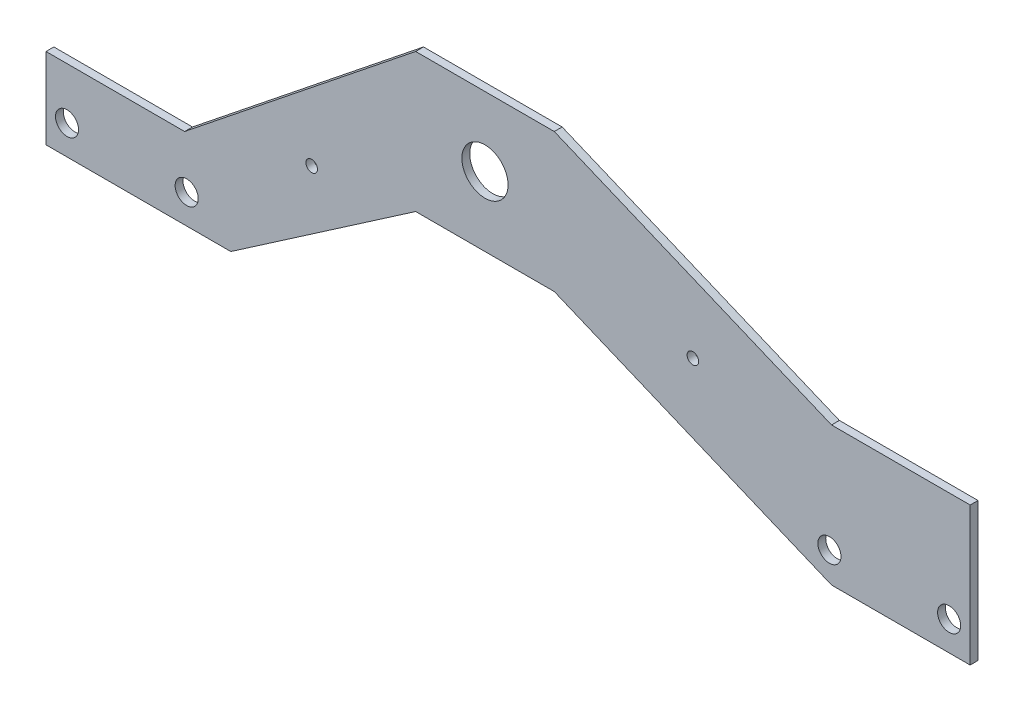
ISO-10303-21;
HEADER;
FILE_DESCRIPTION(('STEP AP214'),'2;1');
FILE_NAME('part.step','',(''),(''),'','','');
FILE_SCHEMA(('AUTOMOTIVE_DESIGN { 1 0 10303 214 1 1 1 1 }'));
ENDSEC;
DATA;
#1=APPLICATION_CONTEXT('core data for automotive mechanical design processes');
#2=APPLICATION_PROTOCOL_DEFINITION('international standard','automotive_design',2000,#1);
#3=PRODUCT_CONTEXT('',#1,'mechanical');
#4=PRODUCT('Part','Part','',(#3));
#5=PRODUCT_RELATED_PRODUCT_CATEGORY('part','',(#4));
#6=PRODUCT_DEFINITION_FORMATION('','',#4);
#7=PRODUCT_DEFINITION_CONTEXT('part definition',#1,'design');
#8=PRODUCT_DEFINITION('design','',#6,#7);
#9=PRODUCT_DEFINITION_SHAPE('','',#8);
#10=(LENGTH_UNIT() NAMED_UNIT(*) SI_UNIT(.MILLI.,.METRE.));
#11=(NAMED_UNIT(*) PLANE_ANGLE_UNIT() SI_UNIT($,.RADIAN.));
#12=(NAMED_UNIT(*) SI_UNIT($,.STERADIAN.) SOLID_ANGLE_UNIT());
#13=UNCERTAINTY_MEASURE_WITH_UNIT(LENGTH_MEASURE(1.E-05),#10,'distance_accuracy_value','');
#14=(GEOMETRIC_REPRESENTATION_CONTEXT(3) GLOBAL_UNCERTAINTY_ASSIGNED_CONTEXT((#13)) GLOBAL_UNIT_ASSIGNED_CONTEXT((#10,
#11,#12)) REPRESENTATION_CONTEXT('',''));
#15=CARTESIAN_POINT('',(0.,0.,0.));
#16=DIRECTION('',(0.,0.,1.));
#17=DIRECTION('',(1.,0.,0.));
#18=AXIS2_PLACEMENT_3D('',#15,#16,#17);
#19=CARTESIAN_POINT('',(215477.868987875,18112.8987341611,-1701.7));
#20=DIRECTION('',(0.,0.,1.));
#21=DIRECTION('',(1.,0.,0.));
#22=AXIS2_PLACEMENT_3D('',#19,#20,#21);
#23=PLANE('',#22);
#24=CARTESIAN_POINT('',(215538.768987875,18090.5987341611,-1701.7));
#25=DIRECTION('',(0.,0.,-1.));
#26=DIRECTION('',(-1.,0.,0.));
#27=AXIS2_PLACEMENT_3D('',#24,#25,#26);
#28=CIRCLE('',#27,5.00000000001207);
#29=CARTESIAN_POINT('',(215533.768987875,18090.5987341611,-1701.7));
#30=VERTEX_POINT('',#29);
#31=EDGE_CURVE('E277',#30,#30,#28,.T.);
#32=ORIENTED_EDGE('',*,*,#31,.F.);
#33=EDGE_LOOP('',(#32));
#34=FACE_BOUND('',#33,.T.);
#35=CARTESIAN_POINT('',(215868.768987875,18095.5987341611,-1701.7));
#36=DIRECTION('',(0.,0.,-1.));
#37=DIRECTION('',(-1.,0.,0.));
#38=AXIS2_PLACEMENT_3D('',#35,#36,#37);
#39=CIRCLE('',#38,5.00000000001207);
#40=CARTESIAN_POINT('',(215863.768987875,18095.5987341611,-1701.7));
#41=VERTEX_POINT('',#40);
#42=EDGE_CURVE('E291',#41,#41,#39,.T.);
#43=ORIENTED_EDGE('',*,*,#42,.F.);
#44=EDGE_LOOP('',(#43));
#45=FACE_BOUND('',#44,.T.);
#46=CARTESIAN_POINT('',(215592.868987875,18127.4687822065,-1701.7));
#47=DIRECTION('',(0.,0.,1.));
#48=DIRECTION('',(1.,0.,0.));
#49=AXIS2_PLACEMENT_3D('',#46,#47,#48);
#50=CIRCLE('',#49,2.50000000000001);
#51=CARTESIAN_POINT('',(215595.368987875,18127.4687822065,-1701.7));
#52=VERTEX_POINT('',#51);
#53=EDGE_CURVE('E294',#52,#52,#50,.T.);
#54=ORIENTED_EDGE('',*,*,#53,.T.);
#55=EDGE_LOOP('',(#54));
#56=FACE_BOUND('',#55,.T.);
#57=CARTESIAN_POINT('',(215757.868987875,18137.8987341611,-1701.7));
#58=DIRECTION('',(0.,0.,1.));
#59=DIRECTION('',(1.,0.,0.));
#60=AXIS2_PLACEMENT_3D('',#57,#58,#59);
#61=CIRCLE('',#60,2.50000000000001);
#62=CARTESIAN_POINT('',(215760.368987875,18137.8987341611,-1701.7));
#63=VERTEX_POINT('',#62);
#64=EDGE_CURVE('E300',#63,#63,#61,.T.);
#65=ORIENTED_EDGE('',*,*,#64,.T.);
#66=EDGE_LOOP('',(#65));
#67=FACE_BOUND('',#66,.T.);
#68=CARTESIAN_POINT('',(215667.868987875,18162.8987341611,-1701.7));
#69=DIRECTION('',(0.,0.,1.));
#70=DIRECTION('',(1.,0.,0.));
#71=AXIS2_PLACEMENT_3D('',#68,#69,#70);
#72=CIRCLE('',#71,9.99999999999999);
#73=CARTESIAN_POINT('',(215677.868987875,18162.8987341611,-1701.7));
#74=VERTEX_POINT('',#73);
#75=EDGE_CURVE('E166',#74,#74,#72,.T.);
#76=ORIENTED_EDGE('',*,*,#75,.T.);
#77=EDGE_LOOP('',(#76));
#78=FACE_BOUND('',#77,.T.);
#79=DIRECTION('',(-1.,0.,0.));
#80=VECTOR('',#79,1.);
#81=CARTESIAN_POINT('',(215477.868987875,18112.8987341611,-1701.7));
#82=LINE('',#81,#80);
#83=CARTESIAN_POINT('',(215537.868987875,18112.8987341611,-1701.7));
#84=VERTEX_POINT('',#83);
#85=CARTESIAN_POINT('',(215477.868987875,18112.8987341611,-1701.7));
#86=VERTEX_POINT('',#85);
#87=EDGE_CURVE('E195',#84,#86,#82,.T.);
#88=ORIENTED_EDGE('',*,*,#87,.F.);
#89=DIRECTION('',(-0.78086880944303,-0.624695047554424,0.));
#90=VECTOR('',#89,1.);
#91=CARTESIAN_POINT('',(215637.868987875,18192.8987341611,-1701.7));
#92=LINE('',#91,#90);
#93=CARTESIAN_POINT('',(215637.868987875,18192.8987341611,-1701.7));
#94=VERTEX_POINT('',#93);
#95=EDGE_CURVE('E152',#94,#84,#92,.T.);
#96=ORIENTED_EDGE('',*,*,#95,.F.);
#97=DIRECTION('',(-1.,0.,0.));
#98=VECTOR('',#97,1.);
#99=CARTESIAN_POINT('',(215697.868987875,18192.8987341611,-1701.7));
#100=LINE('',#99,#98);
#101=CARTESIAN_POINT('',(215697.868987875,18192.8987341611,-1701.7));
#102=VERTEX_POINT('',#101);
#103=EDGE_CURVE('E137',#102,#94,#100,.T.);
#104=ORIENTED_EDGE('',*,*,#103,.F.);
#105=DIRECTION('',(-0.923076923076923,0.384615384615384,0.));
#106=VECTOR('',#105,1.);
#107=CARTESIAN_POINT('',(215817.868987875,18142.8987341611,-1701.7));
#108=LINE('',#107,#106);
#109=CARTESIAN_POINT('',(215817.868987875,18142.8987341611,-1701.7));
#110=VERTEX_POINT('',#109);
#111=EDGE_CURVE('E150',#110,#102,#108,.T.);
#112=ORIENTED_EDGE('',*,*,#111,.F.);
#113=DIRECTION('',(-1.,0.,0.));
#114=VECTOR('',#113,1.);
#115=CARTESIAN_POINT('',(215877.868987875,18142.8987341611,-1701.7));
#116=LINE('',#115,#114);
#117=CARTESIAN_POINT('',(215877.868987875,18142.8987341611,-1701.7));
#118=VERTEX_POINT('',#117);
#119=EDGE_CURVE('E155',#118,#110,#116,.T.);
#120=ORIENTED_EDGE('',*,*,#119,.F.);
#121=DIRECTION('',(0.,1.,0.));
#122=VECTOR('',#121,1.);
#123=CARTESIAN_POINT('',(215877.868987875,18082.8987341611,-1701.7));
#124=LINE('',#123,#122);
#125=CARTESIAN_POINT('',(215877.868987875,18082.8987341611,-1701.7));
#126=VERTEX_POINT('',#125);
#127=EDGE_CURVE('E157',#126,#118,#124,.T.);
#128=ORIENTED_EDGE('',*,*,#127,.F.);
#129=DIRECTION('',(1.,0.,0.));
#130=VECTOR('',#129,1.);
#131=CARTESIAN_POINT('',(215817.868987875,18082.8987341611,-1701.7));
#132=LINE('',#131,#130);
#133=CARTESIAN_POINT('',(215817.868987875,18082.8987341611,-1701.7));
#134=VERTEX_POINT('',#133);
#135=EDGE_CURVE('E325',#134,#126,#132,.T.);
#136=ORIENTED_EDGE('',*,*,#135,.F.);
#137=DIRECTION('',(0.923076923076923,-0.384615384615384,0.));
#138=VECTOR('',#137,1.);
#139=CARTESIAN_POINT('',(215697.868987875,18132.8987341611,-1701.7));
#140=LINE('',#139,#138);
#141=CARTESIAN_POINT('',(215697.868987875,18132.8987341611,-1701.7));
#142=VERTEX_POINT('',#141);
#143=EDGE_CURVE('E322',#142,#134,#140,.T.);
#144=ORIENTED_EDGE('',*,*,#143,.F.);
#145=DIRECTION('',(1.,0.,0.));
#146=VECTOR('',#145,1.);
#147=CARTESIAN_POINT('',(215637.868987875,18132.8987341611,-1701.7));
#148=LINE('',#147,#146);
#149=CARTESIAN_POINT('',(215637.868987875,18132.8987341611,-1701.7));
#150=VERTEX_POINT('',#149);
#151=EDGE_CURVE('E319',#150,#142,#148,.T.);
#152=ORIENTED_EDGE('',*,*,#151,.F.);
#153=DIRECTION('',(0.824041924199368,0.566528822887065,0.));
#154=VECTOR('',#153,1.);
#155=CARTESIAN_POINT('',(215557.868987875,18077.8987341611,-1701.7));
#156=LINE('',#155,#154);
#157=CARTESIAN_POINT('',(215557.868987875,18077.8987341611,-1701.7));
#158=VERTEX_POINT('',#157);
#159=EDGE_CURVE('E316',#158,#150,#156,.T.);
#160=ORIENTED_EDGE('',*,*,#159,.F.);
#161=DIRECTION('',(1.,0.,0.));
#162=VECTOR('',#161,1.);
#163=CARTESIAN_POINT('',(215477.868987875,18077.8987341611,-1701.7));
#164=LINE('',#163,#162);
#165=CARTESIAN_POINT('',(215477.868987875,18077.8987341611,-1701.7));
#166=VERTEX_POINT('',#165);
#167=EDGE_CURVE('E313',#166,#158,#164,.T.);
#168=ORIENTED_EDGE('',*,*,#167,.F.);
#169=DIRECTION('',(0.,-1.,0.));
#170=VECTOR('',#169,1.);
#171=CARTESIAN_POINT('',(215477.868987875,18112.8987341611,-1701.7));
#172=LINE('',#171,#170);
#173=EDGE_CURVE('E311',#86,#166,#172,.T.);
#174=ORIENTED_EDGE('',*,*,#173,.F.);
#175=EDGE_LOOP('',(#88,#96,#104,#112,#120,#128,#136,#144,#152,#160,#168,#174));
#176=FACE_BOUND('',#175,.T.);
#177=CARTESIAN_POINT('',(215816.968987875,18095.5987341611,-1701.7));
#178=DIRECTION('',(0.,0.,-1.));
#179=DIRECTION('',(-1.,0.,0.));
#180=AXIS2_PLACEMENT_3D('',#177,#178,#179);
#181=CIRCLE('',#180,4.99999999998281);
#182=CARTESIAN_POINT('',(215811.968987875,18095.5987341611,-1701.7));
#183=VERTEX_POINT('',#182);
#184=EDGE_CURVE('E285',#183,#183,#181,.F.);
#185=ORIENTED_EDGE('',*,*,#184,.T.);
#186=EDGE_LOOP('',(#185));
#187=FACE_BOUND('',#186,.T.);
#188=CARTESIAN_POINT('',(215486.968987875,18090.5987341611,-1701.7));
#189=DIRECTION('',(0.,0.,-1.));
#190=DIRECTION('',(-1.,0.,0.));
#191=AXIS2_PLACEMENT_3D('',#188,#189,#190);
#192=CIRCLE('',#191,4.99999999998281);
#193=CARTESIAN_POINT('',(215481.968987875,18090.5987341611,-1701.7));
#194=VERTEX_POINT('',#193);
#195=EDGE_CURVE('E270',#194,#194,#192,.F.);
#196=ORIENTED_EDGE('',*,*,#195,.T.);
#197=EDGE_LOOP('',(#196));
#198=FACE_BOUND('',#197,.T.);
#199=ADVANCED_FACE('F40',(#34,#45,#56,#67,#78,#176,#187,#198),#23,.F.);
#200=CARTESIAN_POINT('',(215477.868987875,18112.8987341611,-1698.3));
#201=DIRECTION('',(0.,0.,1.));
#202=DIRECTION('',(1.,0.,0.));
#203=AXIS2_PLACEMENT_3D('',#200,#201,#202);
#204=PLANE('',#203);
#205=CARTESIAN_POINT('',(215816.968987875,18095.5987341611,-1698.3));
#206=DIRECTION('',(0.,0.,-1.));
#207=DIRECTION('',(-1.,0.,0.));
#208=AXIS2_PLACEMENT_3D('',#205,#206,#207);
#209=CIRCLE('',#208,4.99999999998281);
#210=CARTESIAN_POINT('',(215811.968987875,18095.5987341611,-1698.3));
#211=VERTEX_POINT('',#210);
#212=EDGE_CURVE('E282',#211,#211,#209,.F.);
#213=ORIENTED_EDGE('',*,*,#212,.F.);
#214=EDGE_LOOP('',(#213));
#215=FACE_BOUND('',#214,.T.);
#216=CARTESIAN_POINT('',(215868.768987875,18095.5987341611,-1698.3));
#217=DIRECTION('',(0.,0.,-1.));
#218=DIRECTION('',(-1.,0.,0.));
#219=AXIS2_PLACEMENT_3D('',#216,#217,#218);
#220=CIRCLE('',#219,5.00000000001207);
#221=CARTESIAN_POINT('',(215863.768987875,18095.5987341611,-1698.3));
#222=VERTEX_POINT('',#221);
#223=EDGE_CURVE('E288',#222,#222,#220,.T.);
#224=ORIENTED_EDGE('',*,*,#223,.T.);
#225=EDGE_LOOP('',(#224));
#226=FACE_BOUND('',#225,.T.);
#227=CARTESIAN_POINT('',(215592.868987875,18127.4687822065,-1698.3));
#228=DIRECTION('',(0.,0.,1.));
#229=DIRECTION('',(1.,0.,0.));
#230=AXIS2_PLACEMENT_3D('',#227,#228,#229);
#231=CIRCLE('',#230,2.50000000000001);
#232=CARTESIAN_POINT('',(215595.368987875,18127.4687822065,-1698.3));
#233=VERTEX_POINT('',#232);
#234=EDGE_CURVE('E274',#233,#233,#231,.T.);
#235=ORIENTED_EDGE('',*,*,#234,.F.);
#236=EDGE_LOOP('',(#235));
#237=FACE_BOUND('',#236,.T.);
#238=CARTESIAN_POINT('',(215757.868987875,18137.8987341611,-1698.3));
#239=DIRECTION('',(0.,0.,1.));
#240=DIRECTION('',(1.,0.,0.));
#241=AXIS2_PLACEMENT_3D('',#238,#239,#240);
#242=CIRCLE('',#241,2.50000000000001);
#243=CARTESIAN_POINT('',(215760.368987875,18137.8987341611,-1698.3));
#244=VERTEX_POINT('',#243);
#245=EDGE_CURVE('E297',#244,#244,#242,.T.);
#246=ORIENTED_EDGE('',*,*,#245,.F.);
#247=EDGE_LOOP('',(#246));
#248=FACE_BOUND('',#247,.T.);
#249=CARTESIAN_POINT('',(215667.868987875,18162.8987341611,-1698.3));
#250=DIRECTION('',(0.,0.,1.));
#251=DIRECTION('',(1.,0.,0.));
#252=AXIS2_PLACEMENT_3D('',#249,#250,#251);
#253=CIRCLE('',#252,9.99999999999999);
#254=CARTESIAN_POINT('',(215677.868987875,18162.8987341611,-1698.3));
#255=VERTEX_POINT('',#254);
#256=EDGE_CURVE('E303',#255,#255,#253,.T.);
#257=ORIENTED_EDGE('',*,*,#256,.F.);
#258=EDGE_LOOP('',(#257));
#259=FACE_BOUND('',#258,.T.);
#260=DIRECTION('',(-1.,0.,0.));
#261=VECTOR('',#260,1.);
#262=CARTESIAN_POINT('',(215477.868987875,18112.8987341611,-1698.3));
#263=LINE('',#262,#261);
#264=CARTESIAN_POINT('',(215537.868987875,18112.8987341611,-1698.3));
#265=VERTEX_POINT('',#264);
#266=CARTESIAN_POINT('',(215477.868987875,18112.8987341611,-1698.3));
#267=VERTEX_POINT('',#266);
#268=EDGE_CURVE('E162',#265,#267,#263,.T.);
#269=ORIENTED_EDGE('',*,*,#268,.T.);
#270=DIRECTION('',(0.,-1.,0.));
#271=VECTOR('',#270,1.);
#272=CARTESIAN_POINT('',(215477.868987875,18112.8987341611,-1698.3));
#273=LINE('',#272,#271);
#274=CARTESIAN_POINT('',(215477.868987875,18077.8987341611,-1698.3));
#275=VERTEX_POINT('',#274);
#276=EDGE_CURVE('E165',#267,#275,#273,.T.);
#277=ORIENTED_EDGE('',*,*,#276,.T.);
#278=DIRECTION('',(1.,0.,0.));
#279=VECTOR('',#278,1.);
#280=CARTESIAN_POINT('',(215477.868987875,18077.8987341611,-1698.3));
#281=LINE('',#280,#279);
#282=CARTESIAN_POINT('',(215557.868987875,18077.8987341611,-1698.3));
#283=VERTEX_POINT('',#282);
#284=EDGE_CURVE('E169',#275,#283,#281,.T.);
#285=ORIENTED_EDGE('',*,*,#284,.T.);
#286=DIRECTION('',(0.824041924199368,0.566528822887065,0.));
#287=VECTOR('',#286,1.);
#288=CARTESIAN_POINT('',(215557.868987875,18077.8987341611,-1698.3));
#289=LINE('',#288,#287);
#290=CARTESIAN_POINT('',(215637.868987875,18132.8987341611,-1698.3));
#291=VERTEX_POINT('',#290);
#292=EDGE_CURVE('E172',#283,#291,#289,.T.);
#293=ORIENTED_EDGE('',*,*,#292,.T.);
#294=DIRECTION('',(1.,0.,0.));
#295=VECTOR('',#294,1.);
#296=CARTESIAN_POINT('',(215637.868987875,18132.8987341611,-1698.3));
#297=LINE('',#296,#295);
#298=CARTESIAN_POINT('',(215697.868987875,18132.8987341611,-1698.3));
#299=VERTEX_POINT('',#298);
#300=EDGE_CURVE('E175',#291,#299,#297,.T.);
#301=ORIENTED_EDGE('',*,*,#300,.T.);
#302=DIRECTION('',(0.923076923076923,-0.384615384615384,0.));
#303=VECTOR('',#302,1.);
#304=CARTESIAN_POINT('',(215697.868987875,18132.8987341611,-1698.3));
#305=LINE('',#304,#303);
#306=CARTESIAN_POINT('',(215817.868987875,18082.8987341611,-1698.3));
#307=VERTEX_POINT('',#306);
#308=EDGE_CURVE('E178',#299,#307,#305,.T.);
#309=ORIENTED_EDGE('',*,*,#308,.T.);
#310=DIRECTION('',(1.,0.,0.));
#311=VECTOR('',#310,1.);
#312=CARTESIAN_POINT('',(215817.868987875,18082.8987341611,-1698.3));
#313=LINE('',#312,#311);
#314=CARTESIAN_POINT('',(215877.868987875,18082.8987341611,-1698.3));
#315=VERTEX_POINT('',#314);
#316=EDGE_CURVE('E181',#307,#315,#313,.T.);
#317=ORIENTED_EDGE('',*,*,#316,.T.);
#318=DIRECTION('',(0.,1.,0.));
#319=VECTOR('',#318,1.);
#320=CARTESIAN_POINT('',(215877.868987875,18082.8987341611,-1698.3));
#321=LINE('',#320,#319);
#322=CARTESIAN_POINT('',(215877.868987875,18142.8987341611,-1698.3));
#323=VERTEX_POINT('',#322);
#324=EDGE_CURVE('E184',#315,#323,#321,.T.);
#325=ORIENTED_EDGE('',*,*,#324,.T.);
#326=DIRECTION('',(-1.,0.,0.));
#327=VECTOR('',#326,1.);
#328=CARTESIAN_POINT('',(215877.868987875,18142.8987341611,-1698.3));
#329=LINE('',#328,#327);
#330=CARTESIAN_POINT('',(215817.868987875,18142.8987341611,-1698.3));
#331=VERTEX_POINT('',#330);
#332=EDGE_CURVE('E187',#323,#331,#329,.T.);
#333=ORIENTED_EDGE('',*,*,#332,.T.);
#334=DIRECTION('',(-0.923076923076923,0.384615384615384,0.));
#335=VECTOR('',#334,1.);
#336=CARTESIAN_POINT('',(215817.868987875,18142.8987341611,-1698.3));
#337=LINE('',#336,#335);
#338=CARTESIAN_POINT('',(215697.868987875,18192.8987341611,-1698.3));
#339=VERTEX_POINT('',#338);
#340=EDGE_CURVE('E190',#331,#339,#337,.T.);
#341=ORIENTED_EDGE('',*,*,#340,.T.);
#342=DIRECTION('',(-1.,0.,0.));
#343=VECTOR('',#342,1.);
#344=CARTESIAN_POINT('',(215697.868987875,18192.8987341611,-1698.3));
#345=LINE('',#344,#343);
#346=CARTESIAN_POINT('',(215637.868987875,18192.8987341611,-1698.3));
#347=VERTEX_POINT('',#346);
#348=EDGE_CURVE('E139',#339,#347,#345,.T.);
#349=ORIENTED_EDGE('',*,*,#348,.T.);
#350=DIRECTION('',(-0.78086880944303,-0.624695047554424,0.));
#351=VECTOR('',#350,1.);
#352=CARTESIAN_POINT('',(215637.868987875,18192.8987341611,-1698.3));
#353=LINE('',#352,#351);
#354=EDGE_CURVE('E193',#347,#265,#353,.T.);
#355=ORIENTED_EDGE('',*,*,#354,.T.);
#356=EDGE_LOOP('',(#269,#277,#285,#293,#301,#309,#317,#325,#333,#341,#349,#355));
#357=FACE_BOUND('',#356,.T.);
#358=CARTESIAN_POINT('',(215538.768987875,18090.5987341611,-1698.3));
#359=DIRECTION('',(0.,0.,-1.));
#360=DIRECTION('',(-1.,0.,0.));
#361=AXIS2_PLACEMENT_3D('',#358,#359,#360);
#362=CIRCLE('',#361,5.00000000001207);
#363=CARTESIAN_POINT('',(215533.768987875,18090.5987341611,-1698.3));
#364=VERTEX_POINT('',#363);
#365=EDGE_CURVE('E272',#364,#364,#362,.T.);
#366=ORIENTED_EDGE('',*,*,#365,.T.);
#367=EDGE_LOOP('',(#366));
#368=FACE_BOUND('',#367,.T.);
#369=CARTESIAN_POINT('',(215486.968987875,18090.5987341611,-1698.3));
#370=DIRECTION('',(0.,0.,-1.));
#371=DIRECTION('',(-1.,0.,0.));
#372=AXIS2_PLACEMENT_3D('',#369,#370,#371);
#373=CIRCLE('',#372,4.99999999998281);
#374=CARTESIAN_POINT('',(215481.968987875,18090.5987341611,-1698.3));
#375=VERTEX_POINT('',#374);
#376=EDGE_CURVE('E267',#375,#375,#373,.F.);
#377=ORIENTED_EDGE('',*,*,#376,.F.);
#378=EDGE_LOOP('',(#377));
#379=FACE_BOUND('',#378,.T.);
#380=ADVANCED_FACE('F214',(#215,#226,#237,#248,#259,#357,#368,#379),#204,.T.);
#381=CARTESIAN_POINT('',(215477.868987875,18112.8987341611,-1701.7));
#382=DIRECTION('',(0.,1.,0.));
#383=DIRECTION('',(0.,0.,1.));
#384=AXIS2_PLACEMENT_3D('',#381,#382,#383);
#385=PLANE('',#384);
#386=ORIENTED_EDGE('',*,*,#268,.F.);
#387=DIRECTION('',(0.,0.,1.));
#388=VECTOR('',#387,1.);
#389=CARTESIAN_POINT('',(215537.868987875,18112.8987341611,-1701.7));
#390=LINE('',#389,#388);
#391=EDGE_CURVE('E11',#84,#265,#390,.T.);
#392=ORIENTED_EDGE('',*,*,#391,.F.);
#393=ORIENTED_EDGE('',*,*,#87,.T.);
#394=DIRECTION('',(0.,0.,1.));
#395=VECTOR('',#394,1.);
#396=CARTESIAN_POINT('',(215477.868987875,18112.8987341611,-1701.7));
#397=LINE('',#396,#395);
#398=EDGE_CURVE('E44',#86,#267,#397,.T.);
#399=ORIENTED_EDGE('',*,*,#398,.T.);
#400=EDGE_LOOP('',(#386,#392,#393,#399));
#401=FACE_BOUND('',#400,.T.);
#402=ADVANCED_FACE('F42',(#401),#385,.T.);
#403=CARTESIAN_POINT('',(215637.868987875,18192.8987341611,-1701.7));
#404=DIRECTION('',(-0.624695047554424,0.78086880944303,0.));
#405=DIRECTION('',(-0.78086880944303,-0.624695047554424,0.));
#406=AXIS2_PLACEMENT_3D('',#403,#404,#405);
#407=PLANE('',#406);
#408=ORIENTED_EDGE('',*,*,#354,.F.);
#409=DIRECTION('',(0.,0.,1.));
#410=VECTOR('',#409,1.);
#411=CARTESIAN_POINT('',(215637.868987875,18192.8987341611,-1701.7));
#412=LINE('',#411,#410);
#413=EDGE_CURVE('E50',#94,#347,#412,.T.);
#414=ORIENTED_EDGE('',*,*,#413,.F.);
#415=ORIENTED_EDGE('',*,*,#95,.T.);
#416=ORIENTED_EDGE('',*,*,#391,.T.);
#417=EDGE_LOOP('',(#408,#414,#415,#416));
#418=FACE_BOUND('',#417,.T.);
#419=ADVANCED_FACE('F216',(#418),#407,.T.);
#420=CARTESIAN_POINT('',(215697.868987875,18192.8987341611,-1701.7));
#421=DIRECTION('',(0.,1.,0.));
#422=DIRECTION('',(0.,0.,1.));
#423=AXIS2_PLACEMENT_3D('',#420,#421,#422);
#424=PLANE('',#423);
#425=ORIENTED_EDGE('',*,*,#348,.F.);
#426=DIRECTION('',(0.,0.,1.));
#427=VECTOR('',#426,1.);
#428=CARTESIAN_POINT('',(215697.868987875,18192.8987341611,-1701.7));
#429=LINE('',#428,#427);
#430=EDGE_CURVE('E134',#102,#339,#429,.T.);
#431=ORIENTED_EDGE('',*,*,#430,.F.);
#432=ORIENTED_EDGE('',*,*,#103,.T.);
#433=ORIENTED_EDGE('',*,*,#413,.T.);
#434=EDGE_LOOP('',(#425,#431,#432,#433));
#435=FACE_BOUND('',#434,.T.);
#436=ADVANCED_FACE('F136',(#435),#424,.T.);
#437=CARTESIAN_POINT('',(215817.868987875,18142.8987341611,-1701.7));
#438=DIRECTION('',(0.384615384615384,0.923076923076923,0.));
#439=DIRECTION('',(-0.923076923076924,0.384615384615384,0.));
#440=AXIS2_PLACEMENT_3D('',#437,#438,#439);
#441=PLANE('',#440);
#442=ORIENTED_EDGE('',*,*,#340,.F.);
#443=DIRECTION('',(0.,0.,1.));
#444=VECTOR('',#443,1.);
#445=CARTESIAN_POINT('',(215817.868987875,18142.8987341611,-1701.7));
#446=LINE('',#445,#444);
#447=EDGE_CURVE('E144',#110,#331,#446,.T.);
#448=ORIENTED_EDGE('',*,*,#447,.F.);
#449=ORIENTED_EDGE('',*,*,#111,.T.);
#450=ORIENTED_EDGE('',*,*,#430,.T.);
#451=EDGE_LOOP('',(#442,#448,#449,#450));
#452=FACE_BOUND('',#451,.T.);
#453=ADVANCED_FACE('F154',(#452),#441,.T.);
#454=CARTESIAN_POINT('',(215877.868987875,18142.8987341611,-1701.7));
#455=DIRECTION('',(0.,1.,0.));
#456=DIRECTION('',(0.,0.,1.));
#457=AXIS2_PLACEMENT_3D('',#454,#455,#456);
#458=PLANE('',#457);
#459=ORIENTED_EDGE('',*,*,#332,.F.);
#460=DIRECTION('',(0.,0.,1.));
#461=VECTOR('',#460,1.);
#462=CARTESIAN_POINT('',(215877.868987875,18142.8987341611,-1701.7));
#463=LINE('',#462,#461);
#464=EDGE_CURVE('E199',#118,#323,#463,.T.);
#465=ORIENTED_EDGE('',*,*,#464,.F.);
#466=ORIENTED_EDGE('',*,*,#119,.T.);
#467=ORIENTED_EDGE('',*,*,#447,.T.);
#468=EDGE_LOOP('',(#459,#465,#466,#467));
#469=FACE_BOUND('',#468,.T.);
#470=ADVANCED_FACE('F353',(#469),#458,.T.);
#471=CARTESIAN_POINT('',(215877.868987875,18082.8987341611,-1701.7));
#472=DIRECTION('',(1.,0.,0.));
#473=DIRECTION('',(0.,0.,-1.));
#474=AXIS2_PLACEMENT_3D('',#471,#472,#473);
#475=PLANE('',#474);
#476=ORIENTED_EDGE('',*,*,#324,.F.);
#477=DIRECTION('',(0.,0.,1.));
#478=VECTOR('',#477,1.);
#479=CARTESIAN_POINT('',(215877.868987875,18082.8987341611,-1701.7));
#480=LINE('',#479,#478);
#481=EDGE_CURVE('E201',#126,#315,#480,.T.);
#482=ORIENTED_EDGE('',*,*,#481,.F.);
#483=ORIENTED_EDGE('',*,*,#127,.T.);
#484=ORIENTED_EDGE('',*,*,#464,.T.);
#485=EDGE_LOOP('',(#476,#482,#483,#484));
#486=FACE_BOUND('',#485,.T.);
#487=ADVANCED_FACE('F331',(#486),#475,.T.);
#488=CARTESIAN_POINT('',(215817.868987875,18082.8987341611,-1701.7));
#489=DIRECTION('',(0.,-1.,0.));
#490=DIRECTION('',(0.,0.,-1.));
#491=AXIS2_PLACEMENT_3D('',#488,#489,#490);
#492=PLANE('',#491);
#493=ORIENTED_EDGE('',*,*,#316,.F.);
#494=DIRECTION('',(0.,0.,1.));
#495=VECTOR('',#494,1.);
#496=CARTESIAN_POINT('',(215817.868987875,18082.8987341611,-1701.7));
#497=LINE('',#496,#495);
#498=EDGE_CURVE('E203',#134,#307,#497,.T.);
#499=ORIENTED_EDGE('',*,*,#498,.F.);
#500=ORIENTED_EDGE('',*,*,#135,.T.);
#501=ORIENTED_EDGE('',*,*,#481,.T.);
#502=EDGE_LOOP('',(#493,#499,#500,#501));
#503=FACE_BOUND('',#502,.T.);
#504=ADVANCED_FACE('F337',(#503),#492,.T.);
#505=CARTESIAN_POINT('',(215697.868987875,18132.8987341611,-1701.7));
#506=DIRECTION('',(-0.384615384615384,-0.923076923076923,0.));
#507=DIRECTION('',(0.923076923076923,-0.384615384615384,0.));
#508=AXIS2_PLACEMENT_3D('',#505,#506,#507);
#509=PLANE('',#508);
#510=ORIENTED_EDGE('',*,*,#308,.F.);
#511=DIRECTION('',(0.,0.,1.));
#512=VECTOR('',#511,1.);
#513=CARTESIAN_POINT('',(215697.868987875,18132.8987341611,-1701.7));
#514=LINE('',#513,#512);
#515=EDGE_CURVE('E205',#142,#299,#514,.T.);
#516=ORIENTED_EDGE('',*,*,#515,.F.);
#517=ORIENTED_EDGE('',*,*,#143,.T.);
#518=ORIENTED_EDGE('',*,*,#498,.T.);
#519=EDGE_LOOP('',(#510,#516,#517,#518));
#520=FACE_BOUND('',#519,.T.);
#521=ADVANCED_FACE('F340',(#520),#509,.T.);
#522=CARTESIAN_POINT('',(215637.868987875,18132.8987341611,-1701.7));
#523=DIRECTION('',(0.,-1.,0.));
#524=DIRECTION('',(0.,0.,-1.));
#525=AXIS2_PLACEMENT_3D('',#522,#523,#524);
#526=PLANE('',#525);
#527=ORIENTED_EDGE('',*,*,#300,.F.);
#528=DIRECTION('',(0.,0.,1.));
#529=VECTOR('',#528,1.);
#530=CARTESIAN_POINT('',(215637.868987875,18132.8987341611,-1701.7));
#531=LINE('',#530,#529);
#532=EDGE_CURVE('E207',#150,#291,#531,.T.);
#533=ORIENTED_EDGE('',*,*,#532,.F.);
#534=ORIENTED_EDGE('',*,*,#151,.T.);
#535=ORIENTED_EDGE('',*,*,#515,.T.);
#536=EDGE_LOOP('',(#527,#533,#534,#535));
#537=FACE_BOUND('',#536,.T.);
#538=ADVANCED_FACE('F345',(#537),#526,.T.);
#539=CARTESIAN_POINT('',(215557.868987875,18077.8987341611,-1701.7));
#540=DIRECTION('',(0.566528822887065,-0.824041924199368,0.));
#541=DIRECTION('',(0.824041924199368,0.566528822887065,0.));
#542=AXIS2_PLACEMENT_3D('',#539,#540,#541);
#543=PLANE('',#542);
#544=ORIENTED_EDGE('',*,*,#292,.F.);
#545=DIRECTION('',(0.,0.,1.));
#546=VECTOR('',#545,1.);
#547=CARTESIAN_POINT('',(215557.868987875,18077.8987341611,-1701.7));
#548=LINE('',#547,#546);
#549=EDGE_CURVE('E209',#158,#283,#548,.T.);
#550=ORIENTED_EDGE('',*,*,#549,.F.);
#551=ORIENTED_EDGE('',*,*,#159,.T.);
#552=ORIENTED_EDGE('',*,*,#532,.T.);
#553=EDGE_LOOP('',(#544,#550,#551,#552));
#554=FACE_BOUND('',#553,.T.);
#555=ADVANCED_FACE('F348',(#554),#543,.T.);
#556=CARTESIAN_POINT('',(215477.868987875,18077.8987341611,-1701.7));
#557=DIRECTION('',(0.,-1.,0.));
#558=DIRECTION('',(0.,0.,-1.));
#559=AXIS2_PLACEMENT_3D('',#556,#557,#558);
#560=PLANE('',#559);
#561=ORIENTED_EDGE('',*,*,#284,.F.);
#562=DIRECTION('',(0.,0.,1.));
#563=VECTOR('',#562,1.);
#564=CARTESIAN_POINT('',(215477.868987875,18077.8987341611,-1701.7));
#565=LINE('',#564,#563);
#566=EDGE_CURVE('E210',#166,#275,#565,.T.);
#567=ORIENTED_EDGE('',*,*,#566,.F.);
#568=ORIENTED_EDGE('',*,*,#167,.T.);
#569=ORIENTED_EDGE('',*,*,#549,.T.);
#570=EDGE_LOOP('',(#561,#567,#568,#569));
#571=FACE_BOUND('',#570,.T.);
#572=ADVANCED_FACE('F351',(#571),#560,.T.);
#573=CARTESIAN_POINT('',(215477.868987875,18112.8987341611,-1701.7));
#574=DIRECTION('',(-1.,0.,0.));
#575=DIRECTION('',(0.,0.,1.));
#576=AXIS2_PLACEMENT_3D('',#573,#574,#575);
#577=PLANE('',#576);
#578=ORIENTED_EDGE('',*,*,#276,.F.);
#579=ORIENTED_EDGE('',*,*,#398,.F.);
#580=ORIENTED_EDGE('',*,*,#173,.T.);
#581=ORIENTED_EDGE('',*,*,#566,.T.);
#582=EDGE_LOOP('',(#578,#579,#580,#581));
#583=FACE_BOUND('',#582,.T.);
#584=ADVANCED_FACE('F212',(#583),#577,.T.);
#585=CARTESIAN_POINT('',(215667.868987875,18162.8987341611,-1701.7));
#586=DIRECTION('',(0.,0.,1.));
#587=DIRECTION('',(1.,0.,0.));
#588=AXIS2_PLACEMENT_3D('',#585,#586,#587);
#589=CYLINDRICAL_SURFACE('',#588,9.99999999999999);
#590=ORIENTED_EDGE('',*,*,#75,.F.);
#591=EDGE_LOOP('',(#590));
#592=FACE_BOUND('',#591,.T.);
#593=ORIENTED_EDGE('',*,*,#256,.T.);
#594=EDGE_LOOP('',(#593));
#595=FACE_BOUND('',#594,.T.);
#596=ADVANCED_FACE('F235',(#592,#595),#589,.F.);
#597=CARTESIAN_POINT('',(215757.868987875,18137.8987341611,-1701.7));
#598=DIRECTION('',(0.,0.,1.));
#599=DIRECTION('',(1.,0.,0.));
#600=AXIS2_PLACEMENT_3D('',#597,#598,#599);
#601=CYLINDRICAL_SURFACE('',#600,2.50000000000001);
#602=ORIENTED_EDGE('',*,*,#64,.F.);
#603=EDGE_LOOP('',(#602));
#604=FACE_BOUND('',#603,.T.);
#605=ORIENTED_EDGE('',*,*,#245,.T.);
#606=EDGE_LOOP('',(#605));
#607=FACE_BOUND('',#606,.T.);
#608=ADVANCED_FACE('F238',(#604,#607),#601,.F.);
#609=CARTESIAN_POINT('',(215592.868987875,18127.4687822065,-1701.7));
#610=DIRECTION('',(0.,0.,1.));
#611=DIRECTION('',(1.,0.,0.));
#612=AXIS2_PLACEMENT_3D('',#609,#610,#611);
#613=CYLINDRICAL_SURFACE('',#612,2.50000000000001);
#614=ORIENTED_EDGE('',*,*,#53,.F.);
#615=EDGE_LOOP('',(#614));
#616=FACE_BOUND('',#615,.T.);
#617=ORIENTED_EDGE('',*,*,#234,.T.);
#618=EDGE_LOOP('',(#617));
#619=FACE_BOUND('',#618,.T.);
#620=ADVANCED_FACE('F242',(#616,#619),#613,.F.);
#621=CARTESIAN_POINT('',(215868.768987875,18095.5987341611,-1698.3));
#622=DIRECTION('',(0.,0.,-1.));
#623=DIRECTION('',(-1.,0.,0.));
#624=AXIS2_PLACEMENT_3D('',#621,#622,#623);
#625=CYLINDRICAL_SURFACE('',#624,5.00000000001207);
#626=ORIENTED_EDGE('',*,*,#223,.F.);
#627=EDGE_LOOP('',(#626));
#628=FACE_BOUND('',#627,.T.);
#629=ORIENTED_EDGE('',*,*,#42,.T.);
#630=EDGE_LOOP('',(#629));
#631=FACE_BOUND('',#630,.T.);
#632=ADVANCED_FACE('F246',(#628,#631),#625,.F.);
#633=CARTESIAN_POINT('',(215816.968987875,18095.5987341611,-1698.3));
#634=DIRECTION('',(0.,0.,-1.));
#635=DIRECTION('',(-1.,0.,0.));
#636=AXIS2_PLACEMENT_3D('',#633,#634,#635);
#637=CYLINDRICAL_SURFACE('',#636,4.99999999998281);
#638=ORIENTED_EDGE('',*,*,#212,.T.);
#639=EDGE_LOOP('',(#638));
#640=FACE_BOUND('',#639,.T.);
#641=ORIENTED_EDGE('',*,*,#184,.F.);
#642=EDGE_LOOP('',(#641));
#643=FACE_BOUND('',#642,.T.);
#644=ADVANCED_FACE('F250',(#640,#643),#637,.F.);
#645=CARTESIAN_POINT('',(215538.768987875,18090.5987341611,-1698.3));
#646=DIRECTION('',(0.,0.,-1.));
#647=DIRECTION('',(-1.,0.,0.));
#648=AXIS2_PLACEMENT_3D('',#645,#646,#647);
#649=CYLINDRICAL_SURFACE('',#648,5.00000000001207);
#650=ORIENTED_EDGE('',*,*,#365,.F.);
#651=EDGE_LOOP('',(#650));
#652=FACE_BOUND('',#651,.T.);
#653=ORIENTED_EDGE('',*,*,#31,.T.);
#654=EDGE_LOOP('',(#653));
#655=FACE_BOUND('',#654,.T.);
#656=ADVANCED_FACE('F254',(#652,#655),#649,.F.);
#657=CARTESIAN_POINT('',(215486.968987875,18090.5987341611,-1698.3));
#658=DIRECTION('',(0.,0.,-1.));
#659=DIRECTION('',(-1.,0.,0.));
#660=AXIS2_PLACEMENT_3D('',#657,#658,#659);
#661=CYLINDRICAL_SURFACE('',#660,4.99999999998281);
#662=ORIENTED_EDGE('',*,*,#376,.T.);
#663=EDGE_LOOP('',(#662));
#664=FACE_BOUND('',#663,.T.);
#665=ORIENTED_EDGE('',*,*,#195,.F.);
#666=EDGE_LOOP('',(#665));
#667=FACE_BOUND('',#666,.T.);
#668=ADVANCED_FACE('F258',(#664,#667),#661,.F.);
#669=CLOSED_SHELL('',(#199,#380,#402,#419,#436,#453,#470,#487,#504,#521,#538,#555,#572,#584,
#596,#608,#620,#632,#644,#656,#668));
#670=MANIFOLD_SOLID_BREP('B2',#669);
#671=ADVANCED_BREP_SHAPE_REPRESENTATION('',(#18,#670),#14);
#672=SHAPE_DEFINITION_REPRESENTATION(#9,#671);
ENDSEC;
END-ISO-10303-21;
